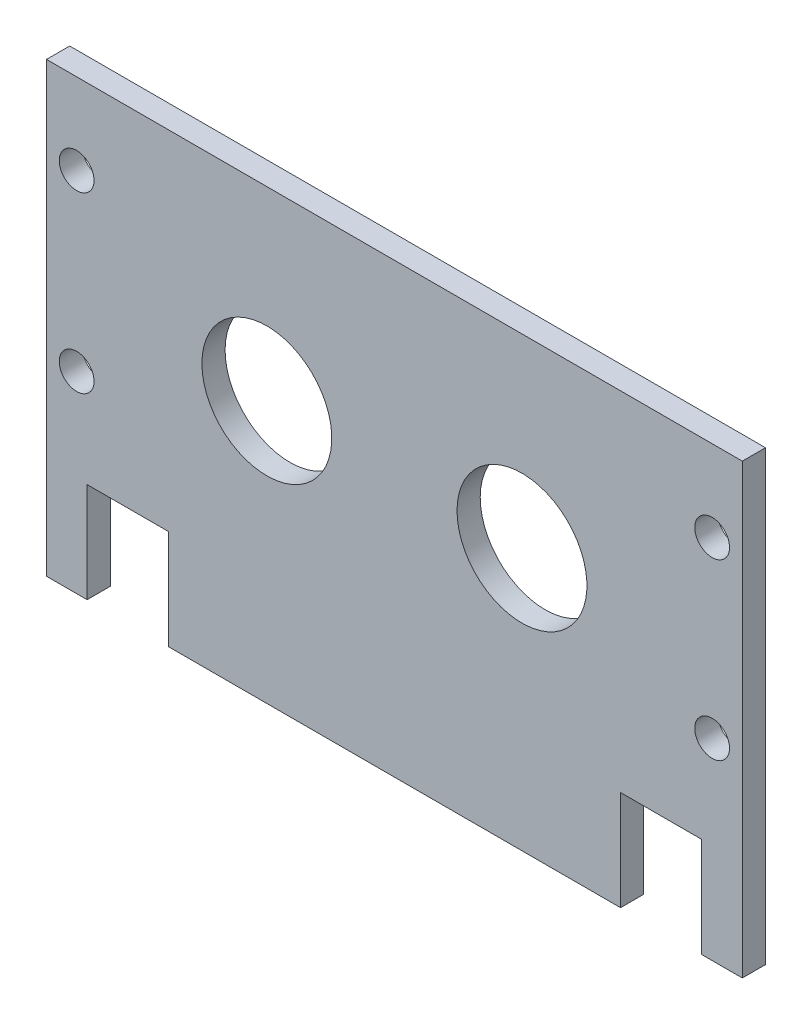
ISO-10303-21;
HEADER;
FILE_DESCRIPTION(('STEP AP214'),'2;1');
FILE_NAME('part.step','',(''),(''),'','','');
FILE_SCHEMA(('AUTOMOTIVE_DESIGN { 1 0 10303 214 1 1 1 1 }'));
ENDSEC;
DATA;
#1=APPLICATION_CONTEXT('core data for automotive mechanical design processes');
#2=APPLICATION_PROTOCOL_DEFINITION('international standard','automotive_design',2000,#1);
#3=PRODUCT_CONTEXT('',#1,'mechanical');
#4=PRODUCT('Part','Part','',(#3));
#5=PRODUCT_RELATED_PRODUCT_CATEGORY('part','',(#4));
#6=PRODUCT_DEFINITION_FORMATION('','',#4);
#7=PRODUCT_DEFINITION_CONTEXT('part definition',#1,'design');
#8=PRODUCT_DEFINITION('design','',#6,#7);
#9=PRODUCT_DEFINITION_SHAPE('','',#8);
#10=(LENGTH_UNIT() NAMED_UNIT(*) SI_UNIT(.MILLI.,.METRE.));
#11=(NAMED_UNIT(*) PLANE_ANGLE_UNIT() SI_UNIT($,.RADIAN.));
#12=(NAMED_UNIT(*) SI_UNIT($,.STERADIAN.) SOLID_ANGLE_UNIT());
#13=UNCERTAINTY_MEASURE_WITH_UNIT(LENGTH_MEASURE(1.E-05),#10,'distance_accuracy_value','');
#14=(GEOMETRIC_REPRESENTATION_CONTEXT(3) GLOBAL_UNCERTAINTY_ASSIGNED_CONTEXT((#13)) GLOBAL_UNIT_ASSIGNED_CONTEXT((#10,
#11,#12)) REPRESENTATION_CONTEXT('',''));
#15=CARTESIAN_POINT('',(0.,0.,0.));
#16=DIRECTION('',(0.,0.,1.));
#17=DIRECTION('',(1.,0.,0.));
#18=AXIS2_PLACEMENT_3D('',#15,#16,#17);
#19=CARTESIAN_POINT('',(-150.,-75.,-10.));
#20=DIRECTION('',(0.,-1.,0.));
#21=DIRECTION('',(0.,0.,-1.));
#22=AXIS2_PLACEMENT_3D('',#19,#20,#21);
#23=PLANE('',#22);
#24=DIRECTION('',(0.,0.,-1.));
#25=VECTOR('',#24,1.);
#26=CARTESIAN_POINT('',(97.5000000000002,-74.9999999999955,0.));
#27=LINE('',#26,#25);
#28=CARTESIAN_POINT('',(97.5000000000002,-75.,0.));
#29=VERTEX_POINT('',#28);
#30=CARTESIAN_POINT('',(97.5000000000002,-74.9999999999955,-10.));
#31=VERTEX_POINT('',#30);
#32=EDGE_CURVE('E174',#29,#31,#27,.T.);
#33=ORIENTED_EDGE('',*,*,#32,.T.);
#34=DIRECTION('',(1.,0.,0.));
#35=VECTOR('',#34,1.);
#36=CARTESIAN_POINT('',(-150.,-75.,-10.));
#37=LINE('',#36,#35);
#38=CARTESIAN_POINT('',(132.5,-75.,-10.));
#39=VERTEX_POINT('',#38);
#40=EDGE_CURVE('E240',#31,#39,#37,.T.);
#41=ORIENTED_EDGE('',*,*,#40,.T.);
#42=DIRECTION('',(0.,0.,-1.));
#43=VECTOR('',#42,1.);
#44=CARTESIAN_POINT('',(132.5,-75.,0.));
#45=LINE('',#44,#43);
#46=CARTESIAN_POINT('',(132.5,-75.,0.));
#47=VERTEX_POINT('',#46);
#48=EDGE_CURVE('E196',#47,#39,#45,.T.);
#49=ORIENTED_EDGE('',*,*,#48,.F.);
#50=DIRECTION('',(1.,0.,0.));
#51=VECTOR('',#50,1.);
#52=CARTESIAN_POINT('',(-150.,-75.,0.));
#53=LINE('',#52,#51);
#54=EDGE_CURVE('E247',#29,#47,#53,.T.);
#55=ORIENTED_EDGE('',*,*,#54,.F.);
#56=EDGE_LOOP('',(#33,#41,#49,#55));
#57=FACE_BOUND('',#56,.T.);
#58=ADVANCED_FACE('F38',(#57),#23,.T.);
#59=CARTESIAN_POINT('',(150.,75.,-10.));
#60=DIRECTION('',(1.,0.,0.));
#61=DIRECTION('',(0.,1.,0.));
#62=AXIS2_PLACEMENT_3D('',#59,#60,#61);
#63=PLANE('',#62);
#64=DIRECTION('',(0.,1.,0.));
#65=VECTOR('',#64,1.);
#66=CARTESIAN_POINT('',(150.,75.,0.));
#67=LINE('',#66,#65);
#68=CARTESIAN_POINT('',(150.,-118.,0.));
#69=VERTEX_POINT('',#68);
#70=CARTESIAN_POINT('',(150.,75.,0.));
#71=VERTEX_POINT('',#70);
#72=EDGE_CURVE('E220',#69,#71,#67,.T.);
#73=ORIENTED_EDGE('',*,*,#72,.F.);
#74=DIRECTION('',(0.,0.,-1.));
#75=VECTOR('',#74,1.);
#76=CARTESIAN_POINT('',(150.,-118.,0.));
#77=LINE('',#76,#75);
#78=CARTESIAN_POINT('',(150.,-118.,-10.));
#79=VERTEX_POINT('',#78);
#80=EDGE_CURVE('E191',#69,#79,#77,.T.);
#81=ORIENTED_EDGE('',*,*,#80,.T.);
#82=DIRECTION('',(0.,1.,0.));
#83=VECTOR('',#82,1.);
#84=CARTESIAN_POINT('',(150.,75.,-10.));
#85=LINE('',#84,#83);
#86=CARTESIAN_POINT('',(150.,75.,-10.));
#87=VERTEX_POINT('',#86);
#88=EDGE_CURVE('E231',#79,#87,#85,.T.);
#89=ORIENTED_EDGE('',*,*,#88,.T.);
#90=DIRECTION('',(0.,0.,1.));
#91=VECTOR('',#90,1.);
#92=CARTESIAN_POINT('',(150.,75.,-10.));
#93=LINE('',#92,#91);
#94=EDGE_CURVE('E47',#87,#71,#93,.T.);
#95=ORIENTED_EDGE('',*,*,#94,.T.);
#96=EDGE_LOOP('',(#73,#81,#89,#95));
#97=FACE_BOUND('',#96,.T.);
#98=ADVANCED_FACE('F40',(#97),#63,.T.);
#99=DIRECTION('',(0.,0.,-1.));
#100=VECTOR('',#99,1.);
#101=CARTESIAN_POINT('',(-132.499999999995,-74.9999999999955,0.));
#102=LINE('',#101,#100);
#103=CARTESIAN_POINT('',(-132.499999999995,-75.,0.));
#104=VERTEX_POINT('',#103);
#105=CARTESIAN_POINT('',(-132.499999999995,-74.9999999999955,-10.));
#106=VERTEX_POINT('',#105);
#107=EDGE_CURVE('E148',#104,#106,#102,.T.);
#108=ORIENTED_EDGE('',*,*,#107,.T.);
#109=CARTESIAN_POINT('',(-97.4999999999951,-74.9999999999955,-10.));
#110=VERTEX_POINT('',#109);
#111=EDGE_CURVE('E241',#106,#110,#37,.T.);
#112=ORIENTED_EDGE('',*,*,#111,.T.);
#113=DIRECTION('',(0.,0.,-1.));
#114=VECTOR('',#113,1.);
#115=CARTESIAN_POINT('',(-97.4999999999951,-74.9999999999955,0.));
#116=LINE('',#115,#114);
#117=CARTESIAN_POINT('',(-97.4999999999951,-74.9999999999955,0.));
#118=VERTEX_POINT('',#117);
#119=EDGE_CURVE('E178',#118,#110,#116,.T.);
#120=ORIENTED_EDGE('',*,*,#119,.F.);
#121=EDGE_CURVE('E235',#104,#118,#53,.T.);
#122=ORIENTED_EDGE('',*,*,#121,.F.);
#123=EDGE_LOOP('',(#108,#112,#120,#122));
#124=FACE_BOUND('',#123,.T.);
#125=ADVANCED_FACE('F310',(#124),#23,.T.);
#126=CARTESIAN_POINT('',(-150.,75.,-10.));
#127=DIRECTION('',(-1.,0.,0.));
#128=DIRECTION('',(0.,0.,1.));
#129=AXIS2_PLACEMENT_3D('',#126,#127,#128);
#130=PLANE('',#129);
#131=DIRECTION('',(0.,-1.,0.));
#132=VECTOR('',#131,1.);
#133=CARTESIAN_POINT('',(-150.,75.,0.));
#134=LINE('',#133,#132);
#135=CARTESIAN_POINT('',(-150.,75.,0.));
#136=VERTEX_POINT('',#135);
#137=CARTESIAN_POINT('',(-149.999999999995,-117.999999999995,0.));
#138=VERTEX_POINT('',#137);
#139=EDGE_CURVE('E143',#136,#138,#134,.T.);
#140=ORIENTED_EDGE('',*,*,#139,.F.);
#141=DIRECTION('',(0.,0.,1.));
#142=VECTOR('',#141,1.);
#143=CARTESIAN_POINT('',(-150.,75.,-10.));
#144=LINE('',#143,#142);
#145=CARTESIAN_POINT('',(-150.,75.,-10.));
#146=VERTEX_POINT('',#145);
#147=EDGE_CURVE('E11',#146,#136,#144,.T.);
#148=ORIENTED_EDGE('',*,*,#147,.F.);
#149=DIRECTION('',(0.,-1.,0.));
#150=VECTOR('',#149,1.);
#151=CARTESIAN_POINT('',(-150.,75.,-10.));
#152=LINE('',#151,#150);
#153=CARTESIAN_POINT('',(-149.999999999995,-117.999999999995,-10.));
#154=VERTEX_POINT('',#153);
#155=EDGE_CURVE('E238',#146,#154,#152,.T.);
#156=ORIENTED_EDGE('',*,*,#155,.T.);
#157=DIRECTION('',(0.,0.,-1.));
#158=VECTOR('',#157,1.);
#159=CARTESIAN_POINT('',(-149.999999999995,-117.999999999995,0.));
#160=LINE('',#159,#158);
#161=EDGE_CURVE('E137',#138,#154,#160,.T.);
#162=ORIENTED_EDGE('',*,*,#161,.F.);
#163=EDGE_LOOP('',(#140,#148,#156,#162));
#164=FACE_BOUND('',#163,.T.);
#165=ADVANCED_FACE('F312',(#164),#130,.T.);
#166=CARTESIAN_POINT('',(-150.,75.,-10.));
#167=DIRECTION('',(0.,1.,0.));
#168=DIRECTION('',(0.,0.,1.));
#169=AXIS2_PLACEMENT_3D('',#166,#167,#168);
#170=PLANE('',#169);
#171=DIRECTION('',(-1.,0.,0.));
#172=VECTOR('',#171,1.);
#173=CARTESIAN_POINT('',(-150.,75.,0.));
#174=LINE('',#173,#172);
#175=EDGE_CURVE('E244',#71,#136,#174,.T.);
#176=ORIENTED_EDGE('',*,*,#175,.F.);
#177=ORIENTED_EDGE('',*,*,#94,.F.);
#178=DIRECTION('',(-1.,0.,0.));
#179=VECTOR('',#178,1.);
#180=CARTESIAN_POINT('',(-150.,75.,-10.));
#181=LINE('',#180,#179);
#182=EDGE_CURVE('E234',#87,#146,#181,.T.);
#183=ORIENTED_EDGE('',*,*,#182,.T.);
#184=ORIENTED_EDGE('',*,*,#147,.T.);
#185=EDGE_LOOP('',(#176,#177,#183,#184));
#186=FACE_BOUND('',#185,.T.);
#187=ADVANCED_FACE('F271',(#186),#170,.T.);
#188=CARTESIAN_POINT('',(0.,0.,-10.));
#189=DIRECTION('',(0.,0.,1.));
#190=DIRECTION('',(1.,0.,0.));
#191=AXIS2_PLACEMENT_3D('',#188,#189,#190);
#192=PLANE('',#191);
#193=CARTESIAN_POINT('',(-137.,40.,-10.));
#194=DIRECTION('',(0.,0.,1.));
#195=DIRECTION('',(1.,0.,0.));
#196=AXIS2_PLACEMENT_3D('',#193,#194,#195);
#197=CIRCLE('',#196,7.50000000000001);
#198=CARTESIAN_POINT('',(-129.5,40.,-10.));
#199=VERTEX_POINT('',#198);
#200=EDGE_CURVE('E204',#199,#199,#197,.T.);
#201=ORIENTED_EDGE('',*,*,#200,.T.);
#202=EDGE_LOOP('',(#201));
#203=FACE_BOUND('',#202,.T.);
#204=CARTESIAN_POINT('',(-137.,-35.,-10.));
#205=DIRECTION('',(0.,0.,1.));
#206=DIRECTION('',(1.,0.,0.));
#207=AXIS2_PLACEMENT_3D('',#204,#205,#206);
#208=CIRCLE('',#207,7.50000000000001);
#209=CARTESIAN_POINT('',(-129.5,-35.,-10.));
#210=VERTEX_POINT('',#209);
#211=EDGE_CURVE('E199',#210,#210,#208,.T.);
#212=ORIENTED_EDGE('',*,*,#211,.T.);
#213=EDGE_LOOP('',(#212));
#214=FACE_BOUND('',#213,.T.);
#215=CARTESIAN_POINT('',(137.,40.,-10.));
#216=DIRECTION('',(0.,0.,-1.));
#217=DIRECTION('',(-1.,0.,0.));
#218=AXIS2_PLACEMENT_3D('',#215,#216,#217);
#219=CIRCLE('',#218,7.50000000000001);
#220=CARTESIAN_POINT('',(129.5,40.,-10.));
#221=VERTEX_POINT('',#220);
#222=EDGE_CURVE('E210',#221,#221,#219,.T.);
#223=ORIENTED_EDGE('',*,*,#222,.F.);
#224=EDGE_LOOP('',(#223));
#225=FACE_BOUND('',#224,.T.);
#226=CARTESIAN_POINT('',(137.,-35.,-10.));
#227=DIRECTION('',(0.,0.,-1.));
#228=DIRECTION('',(-1.,0.,0.));
#229=AXIS2_PLACEMENT_3D('',#226,#227,#228);
#230=CIRCLE('',#229,7.50000000000001);
#231=CARTESIAN_POINT('',(129.5,-35.,-10.));
#232=VERTEX_POINT('',#231);
#233=EDGE_CURVE('E214',#232,#232,#230,.T.);
#234=ORIENTED_EDGE('',*,*,#233,.F.);
#235=EDGE_LOOP('',(#234));
#236=FACE_BOUND('',#235,.T.);
#237=CARTESIAN_POINT('',(55.,-4.99999999999998,-10.));
#238=DIRECTION('',(0.,0.,-1.));
#239=DIRECTION('',(-1.,0.,0.));
#240=AXIS2_PLACEMENT_3D('',#237,#238,#239);
#241=CIRCLE('',#240,28.);
#242=CARTESIAN_POINT('',(27.,-4.99999999999998,-10.));
#243=VERTEX_POINT('',#242);
#244=EDGE_CURVE('E221',#243,#243,#241,.T.);
#245=ORIENTED_EDGE('',*,*,#244,.F.);
#246=EDGE_LOOP('',(#245));
#247=FACE_BOUND('',#246,.T.);
#248=CARTESIAN_POINT('',(-55.,-4.99999999999998,-10.));
#249=DIRECTION('',(0.,0.,-1.));
#250=DIRECTION('',(-1.,0.,0.));
#251=AXIS2_PLACEMENT_3D('',#248,#249,#250);
#252=CIRCLE('',#251,28.);
#253=CARTESIAN_POINT('',(-83.,-4.99999999999998,-10.));
#254=VERTEX_POINT('',#253);
#255=EDGE_CURVE('E227',#254,#254,#252,.T.);
#256=ORIENTED_EDGE('',*,*,#255,.F.);
#257=EDGE_LOOP('',(#256));
#258=FACE_BOUND('',#257,.T.);
#259=ORIENTED_EDGE('',*,*,#88,.F.);
#260=DIRECTION('',(-1.,0.,0.));
#261=VECTOR('',#260,1.);
#262=CARTESIAN_POINT('',(150.,-118.,-10.));
#263=LINE('',#262,#261);
#264=CARTESIAN_POINT('',(132.5,-118.,-10.));
#265=VERTEX_POINT('',#264);
#266=EDGE_CURVE('E177',#79,#265,#263,.T.);
#267=ORIENTED_EDGE('',*,*,#266,.T.);
#268=DIRECTION('',(0.,1.,0.));
#269=VECTOR('',#268,1.);
#270=CARTESIAN_POINT('',(132.5,-75.,-10.));
#271=LINE('',#270,#269);
#272=EDGE_CURVE('E188',#265,#39,#271,.T.);
#273=ORIENTED_EDGE('',*,*,#272,.T.);
#274=ORIENTED_EDGE('',*,*,#40,.F.);
#275=DIRECTION('',(0.,-1.,0.));
#276=VECTOR('',#275,1.);
#277=CARTESIAN_POINT('',(97.5000000000002,-74.9999999999955,-10.));
#278=LINE('',#277,#276);
#279=CARTESIAN_POINT('',(97.5000000000002,-117.999999999995,-10.));
#280=VERTEX_POINT('',#279);
#281=EDGE_CURVE('E156',#31,#280,#278,.T.);
#282=ORIENTED_EDGE('',*,*,#281,.T.);
#283=DIRECTION('',(-1.,0.,0.));
#284=VECTOR('',#283,1.);
#285=CARTESIAN_POINT('',(97.5000000000002,-117.999999999995,-10.));
#286=LINE('',#285,#284);
#287=CARTESIAN_POINT('',(-97.4999999999951,-117.999999999995,-10.));
#288=VERTEX_POINT('',#287);
#289=EDGE_CURVE('E169',#280,#288,#286,.T.);
#290=ORIENTED_EDGE('',*,*,#289,.T.);
#291=DIRECTION('',(0.,1.,0.));
#292=VECTOR('',#291,1.);
#293=CARTESIAN_POINT('',(-97.4999999999951,-74.9999999999955,-10.));
#294=LINE('',#293,#292);
#295=EDGE_CURVE('E160',#288,#110,#294,.T.);
#296=ORIENTED_EDGE('',*,*,#295,.T.);
#297=ORIENTED_EDGE('',*,*,#111,.F.);
#298=DIRECTION('',(0.,-1.,0.));
#299=VECTOR('',#298,1.);
#300=CARTESIAN_POINT('',(-132.499999999995,-74.9999999999955,-10.));
#301=LINE('',#300,#299);
#302=CARTESIAN_POINT('',(-132.499999999995,-117.999999999995,-10.));
#303=VERTEX_POINT('',#302);
#304=EDGE_CURVE('E151',#106,#303,#301,.T.);
#305=ORIENTED_EDGE('',*,*,#304,.T.);
#306=DIRECTION('',(-1.,0.,0.));
#307=VECTOR('',#306,1.);
#308=CARTESIAN_POINT('',(-132.499999999995,-117.999999999995,-10.));
#309=LINE('',#308,#307);
#310=EDGE_CURVE('E134',#303,#154,#309,.T.);
#311=ORIENTED_EDGE('',*,*,#310,.T.);
#312=ORIENTED_EDGE('',*,*,#155,.F.);
#313=ORIENTED_EDGE('',*,*,#182,.F.);
#314=EDGE_LOOP('',(#259,#267,#273,#274,#282,#290,#296,#297,#305,#311,#312,#313));
#315=FACE_BOUND('',#314,.T.);
#316=ADVANCED_FACE('F268',(#203,#214,#225,#236,#247,#258,#315),#192,.F.);
#317=CARTESIAN_POINT('',(0.,0.,0.));
#318=DIRECTION('',(0.,0.,1.));
#319=DIRECTION('',(1.,0.,0.));
#320=AXIS2_PLACEMENT_3D('',#317,#318,#319);
#321=PLANE('',#320);
#322=CARTESIAN_POINT('',(-137.,40.,0.));
#323=DIRECTION('',(0.,0.,1.));
#324=DIRECTION('',(1.,0.,0.));
#325=AXIS2_PLACEMENT_3D('',#322,#323,#324);
#326=CIRCLE('',#325,7.50000000000001);
#327=CARTESIAN_POINT('',(-129.5,40.,0.));
#328=VERTEX_POINT('',#327);
#329=EDGE_CURVE('E42',#328,#328,#326,.F.);
#330=ORIENTED_EDGE('',*,*,#329,.T.);
#331=EDGE_LOOP('',(#330));
#332=FACE_BOUND('',#331,.T.);
#333=CARTESIAN_POINT('',(-137.,-35.,0.));
#334=DIRECTION('',(0.,0.,1.));
#335=DIRECTION('',(1.,0.,0.));
#336=AXIS2_PLACEMENT_3D('',#333,#334,#335);
#337=CIRCLE('',#336,7.50000000000001);
#338=CARTESIAN_POINT('',(-129.5,-35.,0.));
#339=VERTEX_POINT('',#338);
#340=EDGE_CURVE('E207',#339,#339,#337,.F.);
#341=ORIENTED_EDGE('',*,*,#340,.T.);
#342=EDGE_LOOP('',(#341));
#343=FACE_BOUND('',#342,.T.);
#344=CARTESIAN_POINT('',(137.,40.,0.));
#345=DIRECTION('',(0.,0.,1.));
#346=DIRECTION('',(1.,0.,0.));
#347=AXIS2_PLACEMENT_3D('',#344,#345,#346);
#348=CIRCLE('',#347,7.50000000000001);
#349=CARTESIAN_POINT('',(144.5,40.,0.));
#350=VERTEX_POINT('',#349);
#351=EDGE_CURVE('E230',#350,#350,#348,.T.);
#352=ORIENTED_EDGE('',*,*,#351,.F.);
#353=EDGE_LOOP('',(#352));
#354=FACE_BOUND('',#353,.T.);
#355=CARTESIAN_POINT('',(137.,-35.,0.));
#356=DIRECTION('',(0.,0.,1.));
#357=DIRECTION('',(1.,0.,0.));
#358=AXIS2_PLACEMENT_3D('',#355,#356,#357);
#359=CIRCLE('',#358,7.50000000000001);
#360=CARTESIAN_POINT('',(144.5,-35.,0.));
#361=VERTEX_POINT('',#360);
#362=EDGE_CURVE('E213',#361,#361,#359,.T.);
#363=ORIENTED_EDGE('',*,*,#362,.F.);
#364=EDGE_LOOP('',(#363));
#365=FACE_BOUND('',#364,.T.);
#366=CARTESIAN_POINT('',(55.,-4.99999999999998,0.));
#367=DIRECTION('',(0.,0.,-1.));
#368=DIRECTION('',(-1.,0.,0.));
#369=AXIS2_PLACEMENT_3D('',#366,#367,#368);
#370=CIRCLE('',#369,28.);
#371=CARTESIAN_POINT('',(27.,-4.99999999999998,0.));
#372=VERTEX_POINT('',#371);
#373=EDGE_CURVE('E217',#372,#372,#370,.T.);
#374=ORIENTED_EDGE('',*,*,#373,.T.);
#375=EDGE_LOOP('',(#374));
#376=FACE_BOUND('',#375,.T.);
#377=CARTESIAN_POINT('',(-55.,-4.99999999999998,0.));
#378=DIRECTION('',(0.,0.,-1.));
#379=DIRECTION('',(-1.,0.,0.));
#380=AXIS2_PLACEMENT_3D('',#377,#378,#379);
#381=CIRCLE('',#380,28.);
#382=CARTESIAN_POINT('',(-83.,-4.99999999999998,0.));
#383=VERTEX_POINT('',#382);
#384=EDGE_CURVE('E224',#383,#383,#381,.T.);
#385=ORIENTED_EDGE('',*,*,#384,.T.);
#386=EDGE_LOOP('',(#385));
#387=FACE_BOUND('',#386,.T.);
#388=ORIENTED_EDGE('',*,*,#72,.T.);
#389=ORIENTED_EDGE('',*,*,#175,.T.);
#390=ORIENTED_EDGE('',*,*,#139,.T.);
#391=DIRECTION('',(-1.,0.,0.));
#392=VECTOR('',#391,1.);
#393=CARTESIAN_POINT('',(-132.499999999995,-117.999999999995,0.));
#394=LINE('',#393,#392);
#395=CARTESIAN_POINT('',(-132.499999999995,-117.999999999995,0.));
#396=VERTEX_POINT('',#395);
#397=EDGE_CURVE('E132',#396,#138,#394,.T.);
#398=ORIENTED_EDGE('',*,*,#397,.F.);
#399=DIRECTION('',(0.,-1.,0.));
#400=VECTOR('',#399,1.);
#401=CARTESIAN_POINT('',(-132.499999999995,-74.9999999999955,0.));
#402=LINE('',#401,#400);
#403=EDGE_CURVE('E55',#104,#396,#402,.T.);
#404=ORIENTED_EDGE('',*,*,#403,.F.);
#405=ORIENTED_EDGE('',*,*,#121,.T.);
#406=DIRECTION('',(0.,1.,0.));
#407=VECTOR('',#406,1.);
#408=CARTESIAN_POINT('',(-97.4999999999951,-74.9999999999955,0.));
#409=LINE('',#408,#407);
#410=CARTESIAN_POINT('',(-97.4999999999951,-117.999999999995,0.));
#411=VERTEX_POINT('',#410);
#412=EDGE_CURVE('E163',#411,#118,#409,.T.);
#413=ORIENTED_EDGE('',*,*,#412,.F.);
#414=DIRECTION('',(-1.,0.,0.));
#415=VECTOR('',#414,1.);
#416=CARTESIAN_POINT('',(97.5000000000002,-117.999999999995,0.));
#417=LINE('',#416,#415);
#418=CARTESIAN_POINT('',(97.5000000000002,-117.999999999995,0.));
#419=VERTEX_POINT('',#418);
#420=EDGE_CURVE('E159',#419,#411,#417,.T.);
#421=ORIENTED_EDGE('',*,*,#420,.F.);
#422=DIRECTION('',(0.,-1.,0.));
#423=VECTOR('',#422,1.);
#424=CARTESIAN_POINT('',(97.5000000000002,-74.9999999999955,0.));
#425=LINE('',#424,#423);
#426=EDGE_CURVE('E62',#29,#419,#425,.T.);
#427=ORIENTED_EDGE('',*,*,#426,.F.);
#428=ORIENTED_EDGE('',*,*,#54,.T.);
#429=DIRECTION('',(0.,1.,0.));
#430=VECTOR('',#429,1.);
#431=CARTESIAN_POINT('',(132.5,-75.,0.));
#432=LINE('',#431,#430);
#433=CARTESIAN_POINT('',(132.5,-118.,0.));
#434=VERTEX_POINT('',#433);
#435=EDGE_CURVE('E187',#434,#47,#432,.T.);
#436=ORIENTED_EDGE('',*,*,#435,.F.);
#437=DIRECTION('',(-1.,0.,0.));
#438=VECTOR('',#437,1.);
#439=CARTESIAN_POINT('',(150.,-118.,0.));
#440=LINE('',#439,#438);
#441=EDGE_CURVE('E184',#69,#434,#440,.T.);
#442=ORIENTED_EDGE('',*,*,#441,.F.);
#443=EDGE_LOOP('',(#388,#389,#390,#398,#404,#405,#413,#421,#427,#428,#436,#442));
#444=FACE_BOUND('',#443,.T.);
#445=ADVANCED_FACE('F140',(#332,#343,#354,#365,#376,#387,#444),#321,.T.);
#446=CARTESIAN_POINT('',(-55.,-4.99999999999998,0.));
#447=DIRECTION('',(0.,0.,-1.));
#448=DIRECTION('',(-1.,0.,0.));
#449=AXIS2_PLACEMENT_3D('',#446,#447,#448);
#450=CYLINDRICAL_SURFACE('',#449,28.);
#451=ORIENTED_EDGE('',*,*,#384,.F.);
#452=EDGE_LOOP('',(#451));
#453=FACE_BOUND('',#452,.T.);
#454=ORIENTED_EDGE('',*,*,#255,.T.);
#455=EDGE_LOOP('',(#454));
#456=FACE_BOUND('',#455,.T.);
#457=ADVANCED_FACE('F362',(#453,#456),#450,.F.);
#458=CARTESIAN_POINT('',(55.,-4.99999999999998,0.));
#459=DIRECTION('',(0.,0.,-1.));
#460=DIRECTION('',(-1.,0.,0.));
#461=AXIS2_PLACEMENT_3D('',#458,#459,#460);
#462=CYLINDRICAL_SURFACE('',#461,28.);
#463=ORIENTED_EDGE('',*,*,#373,.F.);
#464=EDGE_LOOP('',(#463));
#465=FACE_BOUND('',#464,.T.);
#466=ORIENTED_EDGE('',*,*,#244,.T.);
#467=EDGE_LOOP('',(#466));
#468=FACE_BOUND('',#467,.T.);
#469=ADVANCED_FACE('F470',(#465,#468),#462,.F.);
#470=CARTESIAN_POINT('',(137.,-35.,5.));
#471=DIRECTION('',(0.,0.,-1.));
#472=DIRECTION('',(-1.,0.,0.));
#473=AXIS2_PLACEMENT_3D('',#470,#471,#472);
#474=CYLINDRICAL_SURFACE('',#473,7.50000000000001);
#475=ORIENTED_EDGE('',*,*,#362,.T.);
#476=EDGE_LOOP('',(#475));
#477=FACE_BOUND('',#476,.T.);
#478=ORIENTED_EDGE('',*,*,#233,.T.);
#479=EDGE_LOOP('',(#478));
#480=FACE_BOUND('',#479,.T.);
#481=ADVANCED_FACE('F460',(#477,#480),#474,.F.);
#482=CARTESIAN_POINT('',(137.,40.,5.));
#483=DIRECTION('',(0.,0.,-1.));
#484=DIRECTION('',(-1.,0.,0.));
#485=AXIS2_PLACEMENT_3D('',#482,#483,#484);
#486=CYLINDRICAL_SURFACE('',#485,7.50000000000001);
#487=ORIENTED_EDGE('',*,*,#351,.T.);
#488=EDGE_LOOP('',(#487));
#489=FACE_BOUND('',#488,.T.);
#490=ORIENTED_EDGE('',*,*,#222,.T.);
#491=EDGE_LOOP('',(#490));
#492=FACE_BOUND('',#491,.T.);
#493=ADVANCED_FACE('F450',(#489,#492),#486,.F.);
#494=CARTESIAN_POINT('',(-137.,-35.,5.));
#495=DIRECTION('',(0.,0.,-1.));
#496=DIRECTION('',(-1.,0.,0.));
#497=AXIS2_PLACEMENT_3D('',#494,#495,#496);
#498=CYLINDRICAL_SURFACE('',#497,7.50000000000001);
#499=ORIENTED_EDGE('',*,*,#340,.F.);
#500=EDGE_LOOP('',(#499));
#501=FACE_BOUND('',#500,.T.);
#502=ORIENTED_EDGE('',*,*,#211,.F.);
#503=EDGE_LOOP('',(#502));
#504=FACE_BOUND('',#503,.T.);
#505=ADVANCED_FACE('F264',(#501,#504),#498,.F.);
#506=CARTESIAN_POINT('',(-137.,40.,5.));
#507=DIRECTION('',(0.,0.,-1.));
#508=DIRECTION('',(-1.,0.,0.));
#509=AXIS2_PLACEMENT_3D('',#506,#507,#508);
#510=CYLINDRICAL_SURFACE('',#509,7.50000000000001);
#511=ORIENTED_EDGE('',*,*,#329,.F.);
#512=EDGE_LOOP('',(#511));
#513=FACE_BOUND('',#512,.T.);
#514=ORIENTED_EDGE('',*,*,#200,.F.);
#515=EDGE_LOOP('',(#514));
#516=FACE_BOUND('',#515,.T.);
#517=ADVANCED_FACE('F260',(#513,#516),#510,.F.);
#518=CARTESIAN_POINT('',(132.5,-75.,0.));
#519=DIRECTION('',(-1.,0.,0.));
#520=DIRECTION('',(0.,0.,1.));
#521=AXIS2_PLACEMENT_3D('',#518,#519,#520);
#522=PLANE('',#521);
#523=ORIENTED_EDGE('',*,*,#272,.F.);
#524=DIRECTION('',(0.,0.,-1.));
#525=VECTOR('',#524,1.);
#526=CARTESIAN_POINT('',(132.5,-118.,0.));
#527=LINE('',#526,#525);
#528=EDGE_CURVE('E200',#434,#265,#527,.T.);
#529=ORIENTED_EDGE('',*,*,#528,.F.);
#530=ORIENTED_EDGE('',*,*,#435,.T.);
#531=ORIENTED_EDGE('',*,*,#48,.T.);
#532=EDGE_LOOP('',(#523,#529,#530,#531));
#533=FACE_BOUND('',#532,.T.);
#534=ADVANCED_FACE('F263',(#533),#522,.T.);
#535=CARTESIAN_POINT('',(150.,-118.,0.));
#536=DIRECTION('',(0.,-1.,0.));
#537=DIRECTION('',(0.,0.,-1.));
#538=AXIS2_PLACEMENT_3D('',#535,#536,#537);
#539=PLANE('',#538);
#540=ORIENTED_EDGE('',*,*,#266,.F.);
#541=ORIENTED_EDGE('',*,*,#80,.F.);
#542=ORIENTED_EDGE('',*,*,#441,.T.);
#543=ORIENTED_EDGE('',*,*,#528,.T.);
#544=EDGE_LOOP('',(#540,#541,#542,#543));
#545=FACE_BOUND('',#544,.T.);
#546=ADVANCED_FACE('F290',(#545),#539,.T.);
#547=CARTESIAN_POINT('',(97.5000000000002,-74.9999999999955,0.));
#548=DIRECTION('',(1.,0.,0.));
#549=DIRECTION('',(0.,1.,0.));
#550=AXIS2_PLACEMENT_3D('',#547,#548,#549);
#551=PLANE('',#550);
#552=ORIENTED_EDGE('',*,*,#281,.F.);
#553=ORIENTED_EDGE('',*,*,#32,.F.);
#554=ORIENTED_EDGE('',*,*,#426,.T.);
#555=DIRECTION('',(0.,0.,-1.));
#556=VECTOR('',#555,1.);
#557=CARTESIAN_POINT('',(97.5000000000002,-117.999999999995,0.));
#558=LINE('',#557,#556);
#559=EDGE_CURVE('E166',#419,#280,#558,.T.);
#560=ORIENTED_EDGE('',*,*,#559,.T.);
#561=EDGE_LOOP('',(#552,#553,#554,#560));
#562=FACE_BOUND('',#561,.T.);
#563=ADVANCED_FACE('F299',(#562),#551,.T.);
#564=CARTESIAN_POINT('',(-97.4999999999951,-74.9999999999955,0.));
#565=DIRECTION('',(-1.,0.,0.));
#566=DIRECTION('',(0.,-1.,0.));
#567=AXIS2_PLACEMENT_3D('',#564,#565,#566);
#568=PLANE('',#567);
#569=ORIENTED_EDGE('',*,*,#295,.F.);
#570=DIRECTION('',(0.,0.,-1.));
#571=VECTOR('',#570,1.);
#572=CARTESIAN_POINT('',(-97.4999999999951,-117.999999999995,0.));
#573=LINE('',#572,#571);
#574=EDGE_CURVE('E181',#411,#288,#573,.T.);
#575=ORIENTED_EDGE('',*,*,#574,.F.);
#576=ORIENTED_EDGE('',*,*,#412,.T.);
#577=ORIENTED_EDGE('',*,*,#119,.T.);
#578=EDGE_LOOP('',(#569,#575,#576,#577));
#579=FACE_BOUND('',#578,.T.);
#580=ADVANCED_FACE('F306',(#579),#568,.T.);
#581=CARTESIAN_POINT('',(97.5000000000002,-117.999999999995,0.));
#582=DIRECTION('',(0.,-1.,0.));
#583=DIRECTION('',(0.,0.,-1.));
#584=AXIS2_PLACEMENT_3D('',#581,#582,#583);
#585=PLANE('',#584);
#586=ORIENTED_EDGE('',*,*,#289,.F.);
#587=ORIENTED_EDGE('',*,*,#559,.F.);
#588=ORIENTED_EDGE('',*,*,#420,.T.);
#589=ORIENTED_EDGE('',*,*,#574,.T.);
#590=EDGE_LOOP('',(#586,#587,#588,#589));
#591=FACE_BOUND('',#590,.T.);
#592=ADVANCED_FACE('F302',(#591),#585,.T.);
#593=CARTESIAN_POINT('',(-132.499999999995,-74.9999999999955,0.));
#594=DIRECTION('',(1.,0.,0.));
#595=DIRECTION('',(0.,0.,-1.));
#596=AXIS2_PLACEMENT_3D('',#593,#594,#595);
#597=PLANE('',#596);
#598=ORIENTED_EDGE('',*,*,#304,.F.);
#599=ORIENTED_EDGE('',*,*,#107,.F.);
#600=ORIENTED_EDGE('',*,*,#403,.T.);
#601=DIRECTION('',(0.,0.,-1.));
#602=VECTOR('',#601,1.);
#603=CARTESIAN_POINT('',(-132.499999999995,-117.999999999995,0.));
#604=LINE('',#603,#602);
#605=EDGE_CURVE('E129',#396,#303,#604,.T.);
#606=ORIENTED_EDGE('',*,*,#605,.T.);
#607=EDGE_LOOP('',(#598,#599,#600,#606));
#608=FACE_BOUND('',#607,.T.);
#609=ADVANCED_FACE('F146',(#608),#597,.T.);
#610=CARTESIAN_POINT('',(-132.499999999995,-117.999999999995,0.));
#611=DIRECTION('',(0.,-1.,0.));
#612=DIRECTION('',(0.,0.,-1.));
#613=AXIS2_PLACEMENT_3D('',#610,#611,#612);
#614=PLANE('',#613);
#615=ORIENTED_EDGE('',*,*,#310,.F.);
#616=ORIENTED_EDGE('',*,*,#605,.F.);
#617=ORIENTED_EDGE('',*,*,#397,.T.);
#618=ORIENTED_EDGE('',*,*,#161,.T.);
#619=EDGE_LOOP('',(#615,#616,#617,#618));
#620=FACE_BOUND('',#619,.T.);
#621=ADVANCED_FACE('F130',(#620),#614,.T.);
#622=CLOSED_SHELL('',(#58,#98,#125,#165,#187,#316,#445,#457,#469,#481,#493,#505,#517,#534,#546,
#563,#580,#592,#609,#621));
#623=MANIFOLD_SOLID_BREP('B2',#622);
#624=ADVANCED_BREP_SHAPE_REPRESENTATION('',(#18,#623),#14);
#625=SHAPE_DEFINITION_REPRESENTATION(#9,#624);
ENDSEC;
END-ISO-10303-21;
